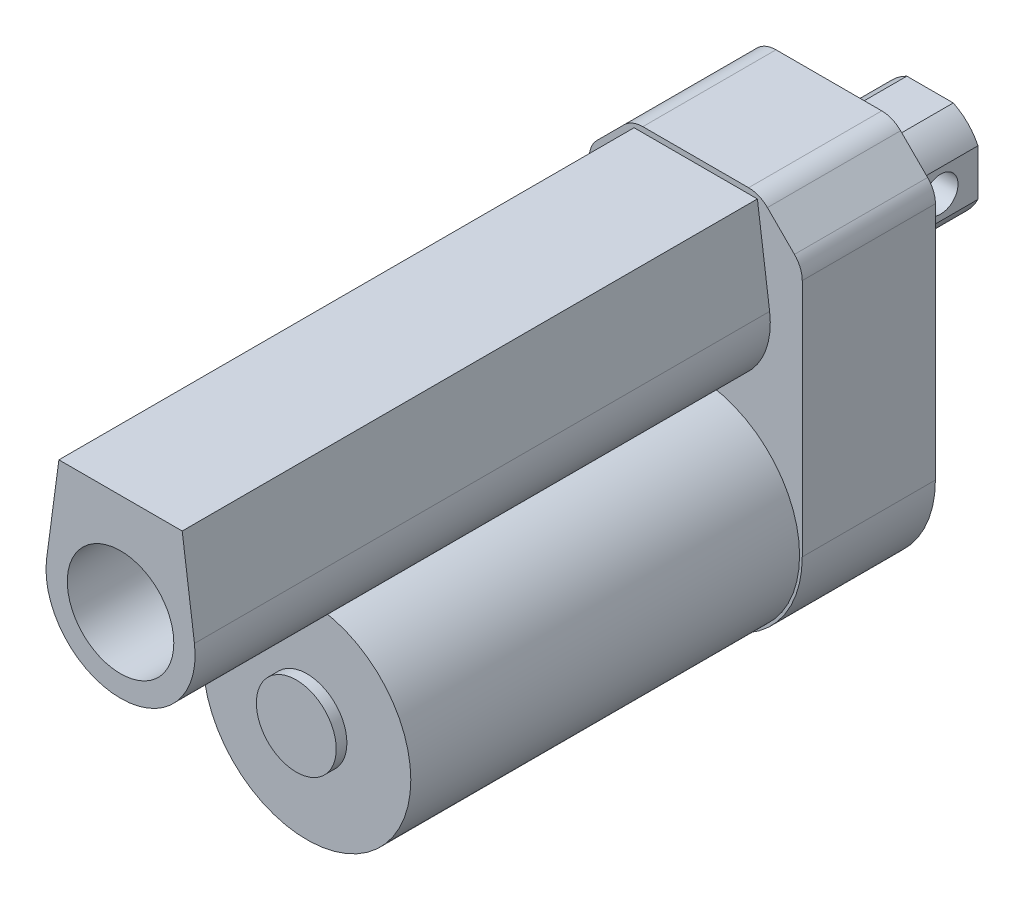
ISO-10303-21;
HEADER;
FILE_DESCRIPTION(('STEP AP214'),'2;1');
FILE_NAME('part.step','',(''),(''),'','','');
FILE_SCHEMA(('AUTOMOTIVE_DESIGN { 1 0 10303 214 1 1 1 1 }'));
ENDSEC;
DATA;
#1=APPLICATION_CONTEXT('core data for automotive mechanical design processes');
#2=APPLICATION_PROTOCOL_DEFINITION('international standard','automotive_design',2000,#1);
#3=PRODUCT_CONTEXT('',#1,'mechanical');
#4=PRODUCT('Part','Part','',(#3));
#5=PRODUCT_RELATED_PRODUCT_CATEGORY('part','',(#4));
#6=PRODUCT_DEFINITION_FORMATION('','',#4);
#7=PRODUCT_DEFINITION_CONTEXT('part definition',#1,'design');
#8=PRODUCT_DEFINITION('design','',#6,#7);
#9=PRODUCT_DEFINITION_SHAPE('','',#8);
#10=(LENGTH_UNIT() NAMED_UNIT(*) SI_UNIT(.MILLI.,.METRE.));
#11=(NAMED_UNIT(*) PLANE_ANGLE_UNIT() SI_UNIT($,.RADIAN.));
#12=(NAMED_UNIT(*) SI_UNIT($,.STERADIAN.) SOLID_ANGLE_UNIT());
#13=UNCERTAINTY_MEASURE_WITH_UNIT(LENGTH_MEASURE(1.E-05),#10,'distance_accuracy_value','');
#14=(GEOMETRIC_REPRESENTATION_CONTEXT(3) GLOBAL_UNCERTAINTY_ASSIGNED_CONTEXT((#13)) GLOBAL_UNIT_ASSIGNED_CONTEXT((#10,
#11,#12)) REPRESENTATION_CONTEXT('',''));
#15=CARTESIAN_POINT('',(0.,0.,0.));
#16=DIRECTION('',(0.,0.,1.));
#17=DIRECTION('',(1.,0.,0.));
#18=AXIS2_PLACEMENT_3D('',#15,#16,#17);
#19=CARTESIAN_POINT('',(0.,35.,-19.));
#20=DIRECTION('',(0.,0.,1.));
#21=DIRECTION('',(1.,0.,0.));
#22=AXIS2_PLACEMENT_3D('',#19,#20,#21);
#23=CYLINDRICAL_SURFACE('',#22,10.);
#24=CARTESIAN_POINT('',(0.,35.,0.));
#25=DIRECTION('',(0.,0.,-1.));
#26=DIRECTION('',(-1.,0.,0.));
#27=AXIS2_PLACEMENT_3D('',#24,#25,#26);
#28=CIRCLE('',#27,10.);
#29=CARTESIAN_POINT('',(9.00000000000001,30.6411010564594,0.));
#30=VERTEX_POINT('',#29);
#31=CARTESIAN_POINT('',(4.35889894354065,26.,0.));
#32=VERTEX_POINT('',#31);
#33=EDGE_CURVE('E141',#30,#32,#28,.T.);
#34=ORIENTED_EDGE('',*,*,#33,.T.);
#35=DIRECTION('',(0.,0.,1.));
#36=VECTOR('',#35,1.);
#37=CARTESIAN_POINT('',(4.35889894354065,26.,-19.));
#38=LINE('',#37,#36);
#39=CARTESIAN_POINT('',(4.35889894354065,26.,-19.));
#40=VERTEX_POINT('',#39);
#41=EDGE_CURVE('E12',#40,#32,#38,.T.);
#42=ORIENTED_EDGE('',*,*,#41,.F.);
#43=CARTESIAN_POINT('',(0.,35.,-19.));
#44=DIRECTION('',(0.,0.,-1.));
#45=DIRECTION('',(-1.,0.,0.));
#46=AXIS2_PLACEMENT_3D('',#43,#44,#45);
#47=CIRCLE('',#46,10.);
#48=CARTESIAN_POINT('',(9.00000000000001,30.6411010564594,-19.));
#49=VERTEX_POINT('',#48);
#50=EDGE_CURVE('E156',#49,#40,#47,.T.);
#51=ORIENTED_EDGE('',*,*,#50,.F.);
#52=DIRECTION('',(0.,0.,1.));
#53=VECTOR('',#52,1.);
#54=CARTESIAN_POINT('',(9.00000000000001,30.6411010564594,-19.));
#55=LINE('',#54,#53);
#56=EDGE_CURVE('E137',#49,#30,#55,.T.);
#57=ORIENTED_EDGE('',*,*,#56,.T.);
#58=EDGE_LOOP('',(#34,#42,#51,#57));
#59=FACE_BOUND('',#58,.T.);
#60=ADVANCED_FACE('F45',(#59),#23,.T.);
#61=CARTESIAN_POINT('',(4.35889894354065,26.,-19.));
#62=DIRECTION('',(0.,1.,0.));
#63=DIRECTION('',(0.,0.,1.));
#64=AXIS2_PLACEMENT_3D('',#61,#62,#63);
#65=PLANE('',#64);
#66=DIRECTION('',(-1.,0.,0.));
#67=VECTOR('',#66,1.);
#68=CARTESIAN_POINT('',(4.35889894354065,26.,0.));
#69=LINE('',#68,#67);
#70=CARTESIAN_POINT('',(-4.35889894354066,26.,0.));
#71=VERTEX_POINT('',#70);
#72=EDGE_CURVE('E144',#32,#71,#69,.T.);
#73=ORIENTED_EDGE('',*,*,#72,.T.);
#74=DIRECTION('',(0.,0.,1.));
#75=VECTOR('',#74,1.);
#76=CARTESIAN_POINT('',(-4.35889894354066,26.,-19.));
#77=LINE('',#76,#75);
#78=CARTESIAN_POINT('',(-4.35889894354066,26.,-19.));
#79=VERTEX_POINT('',#78);
#80=EDGE_CURVE('E53',#79,#71,#77,.T.);
#81=ORIENTED_EDGE('',*,*,#80,.F.);
#82=DIRECTION('',(-1.,0.,0.));
#83=VECTOR('',#82,1.);
#84=CARTESIAN_POINT('',(4.35889894354065,26.,-19.));
#85=LINE('',#84,#83);
#86=EDGE_CURVE('E104',#40,#79,#85,.T.);
#87=ORIENTED_EDGE('',*,*,#86,.F.);
#88=ORIENTED_EDGE('',*,*,#41,.T.);
#89=EDGE_LOOP('',(#73,#81,#87,#88));
#90=FACE_BOUND('',#89,.T.);
#91=ADVANCED_FACE('F209',(#90),#65,.F.);
#92=CARTESIAN_POINT('',(0.,35.,-19.));
#93=DIRECTION('',(0.,0.,1.));
#94=DIRECTION('',(1.,0.,0.));
#95=AXIS2_PLACEMENT_3D('',#92,#93,#94);
#96=CYLINDRICAL_SURFACE('',#95,10.);
#97=CARTESIAN_POINT('',(0.,35.,0.));
#98=DIRECTION('',(0.,0.,-1.));
#99=DIRECTION('',(-1.,0.,0.));
#100=AXIS2_PLACEMENT_3D('',#97,#98,#99);
#101=CIRCLE('',#100,10.);
#102=CARTESIAN_POINT('',(-9.00000000000001,30.6411010564594,0.));
#103=VERTEX_POINT('',#102);
#104=EDGE_CURVE('E147',#71,#103,#101,.T.);
#105=ORIENTED_EDGE('',*,*,#104,.T.);
#106=DIRECTION('',(0.,0.,1.));
#107=VECTOR('',#106,1.);
#108=CARTESIAN_POINT('',(-9.00000000000001,30.6411010564594,-19.));
#109=LINE('',#108,#107);
#110=CARTESIAN_POINT('',(-9.00000000000001,30.6411010564594,-19.));
#111=VERTEX_POINT('',#110);
#112=EDGE_CURVE('E163',#111,#103,#109,.T.);
#113=ORIENTED_EDGE('',*,*,#112,.F.);
#114=CARTESIAN_POINT('',(0.,35.,-19.));
#115=DIRECTION('',(0.,0.,-1.));
#116=DIRECTION('',(-1.,0.,0.));
#117=AXIS2_PLACEMENT_3D('',#114,#115,#116);
#118=CIRCLE('',#117,10.);
#119=EDGE_CURVE('E171',#79,#111,#118,.T.);
#120=ORIENTED_EDGE('',*,*,#119,.F.);
#121=ORIENTED_EDGE('',*,*,#80,.T.);
#122=EDGE_LOOP('',(#105,#113,#120,#121));
#123=FACE_BOUND('',#122,.T.);
#124=ADVANCED_FACE('F169',(#123),#96,.T.);
#125=CARTESIAN_POINT('',(-9.,39.3588989435407,-19.));
#126=DIRECTION('',(1.,0.,0.));
#127=DIRECTION('',(0.,1.,0.));
#128=AXIS2_PLACEMENT_3D('',#125,#126,#127);
#129=PLANE('',#128);
#130=CARTESIAN_POINT('',(-9.00000000000001,35.,-12.));
#131=DIRECTION('',(1.,0.,0.));
#132=DIRECTION('',(0.,1.,0.));
#133=AXIS2_PLACEMENT_3D('',#130,#131,#132);
#134=CIRCLE('',#133,3.25);
#135=CARTESIAN_POINT('',(-9.,38.25,-12.));
#136=VERTEX_POINT('',#135);
#137=EDGE_CURVE('E145',#136,#136,#134,.T.);
#138=ORIENTED_EDGE('',*,*,#137,.T.);
#139=EDGE_LOOP('',(#138));
#140=FACE_BOUND('',#139,.T.);
#141=DIRECTION('',(0.,1.,0.));
#142=VECTOR('',#141,1.);
#143=CARTESIAN_POINT('',(-9.,39.3588989435407,0.));
#144=LINE('',#143,#142);
#145=CARTESIAN_POINT('',(-9.,39.3588989435407,0.));
#146=VERTEX_POINT('',#145);
#147=EDGE_CURVE('E149',#103,#146,#144,.T.);
#148=ORIENTED_EDGE('',*,*,#147,.T.);
#149=DIRECTION('',(0.,0.,1.));
#150=VECTOR('',#149,1.);
#151=CARTESIAN_POINT('',(-9.,39.3588989435407,-19.));
#152=LINE('',#151,#150);
#153=CARTESIAN_POINT('',(-9.,39.3588989435407,-19.));
#154=VERTEX_POINT('',#153);
#155=EDGE_CURVE('E160',#154,#146,#152,.T.);
#156=ORIENTED_EDGE('',*,*,#155,.F.);
#157=DIRECTION('',(0.,1.,0.));
#158=VECTOR('',#157,1.);
#159=CARTESIAN_POINT('',(-9.,39.3588989435407,-19.));
#160=LINE('',#159,#158);
#161=EDGE_CURVE('E183',#111,#154,#160,.T.);
#162=ORIENTED_EDGE('',*,*,#161,.F.);
#163=ORIENTED_EDGE('',*,*,#112,.T.);
#164=EDGE_LOOP('',(#148,#156,#162,#163));
#165=FACE_BOUND('',#164,.T.);
#166=ADVANCED_FACE('F179',(#140,#165),#129,.F.);
#167=CARTESIAN_POINT('',(0.,35.,-19.));
#168=DIRECTION('',(0.,0.,1.));
#169=DIRECTION('',(1.,0.,0.));
#170=AXIS2_PLACEMENT_3D('',#167,#168,#169);
#171=CYLINDRICAL_SURFACE('',#170,10.);
#172=CARTESIAN_POINT('',(0.,35.,0.));
#173=DIRECTION('',(0.,0.,-1.));
#174=DIRECTION('',(-1.,0.,0.));
#175=AXIS2_PLACEMENT_3D('',#172,#173,#174);
#176=CIRCLE('',#175,10.);
#177=CARTESIAN_POINT('',(-4.3588989435407,44.,0.));
#178=VERTEX_POINT('',#177);
#179=EDGE_CURVE('E151',#146,#178,#176,.T.);
#180=ORIENTED_EDGE('',*,*,#179,.T.);
#181=DIRECTION('',(0.,0.,1.));
#182=VECTOR('',#181,1.);
#183=CARTESIAN_POINT('',(-4.3588989435407,44.,-19.));
#184=LINE('',#183,#182);
#185=CARTESIAN_POINT('',(-4.3588989435407,44.,-19.));
#186=VERTEX_POINT('',#185);
#187=EDGE_CURVE('E132',#186,#178,#184,.T.);
#188=ORIENTED_EDGE('',*,*,#187,.F.);
#189=CARTESIAN_POINT('',(0.,35.,-19.));
#190=DIRECTION('',(0.,0.,-1.));
#191=DIRECTION('',(-1.,0.,0.));
#192=AXIS2_PLACEMENT_3D('',#189,#190,#191);
#193=CIRCLE('',#192,10.);
#194=EDGE_CURVE('E123',#154,#186,#193,.T.);
#195=ORIENTED_EDGE('',*,*,#194,.F.);
#196=ORIENTED_EDGE('',*,*,#155,.T.);
#197=EDGE_LOOP('',(#180,#188,#195,#196));
#198=FACE_BOUND('',#197,.T.);
#199=ADVANCED_FACE('F182',(#198),#171,.T.);
#200=CARTESIAN_POINT('',(4.3588989435407,44.,-19.));
#201=DIRECTION('',(0.,-1.,0.));
#202=DIRECTION('',(0.,0.,-1.));
#203=AXIS2_PLACEMENT_3D('',#200,#201,#202);
#204=PLANE('',#203);
#205=DIRECTION('',(1.,0.,0.));
#206=VECTOR('',#205,1.);
#207=CARTESIAN_POINT('',(4.3588989435407,44.,0.));
#208=LINE('',#207,#206);
#209=CARTESIAN_POINT('',(4.3588989435407,44.,0.));
#210=VERTEX_POINT('',#209);
#211=EDGE_CURVE('E131',#178,#210,#208,.T.);
#212=ORIENTED_EDGE('',*,*,#211,.T.);
#213=DIRECTION('',(0.,0.,1.));
#214=VECTOR('',#213,1.);
#215=CARTESIAN_POINT('',(4.3588989435407,44.,-19.));
#216=LINE('',#215,#214);
#217=CARTESIAN_POINT('',(4.3588989435407,44.,-19.));
#218=VERTEX_POINT('',#217);
#219=EDGE_CURVE('E128',#218,#210,#216,.T.);
#220=ORIENTED_EDGE('',*,*,#219,.F.);
#221=DIRECTION('',(1.,0.,0.));
#222=VECTOR('',#221,1.);
#223=CARTESIAN_POINT('',(4.3588989435407,44.,-19.));
#224=LINE('',#223,#222);
#225=EDGE_CURVE('E117',#186,#218,#224,.T.);
#226=ORIENTED_EDGE('',*,*,#225,.F.);
#227=ORIENTED_EDGE('',*,*,#187,.T.);
#228=EDGE_LOOP('',(#212,#220,#226,#227));
#229=FACE_BOUND('',#228,.T.);
#230=ADVANCED_FACE('F129',(#229),#204,.F.);
#231=CARTESIAN_POINT('',(0.,35.,-19.));
#232=DIRECTION('',(0.,0.,1.));
#233=DIRECTION('',(1.,0.,0.));
#234=AXIS2_PLACEMENT_3D('',#231,#232,#233);
#235=CYLINDRICAL_SURFACE('',#234,10.);
#236=CARTESIAN_POINT('',(0.,35.,0.));
#237=DIRECTION('',(0.,0.,-1.));
#238=DIRECTION('',(-1.,0.,0.));
#239=AXIS2_PLACEMENT_3D('',#236,#237,#238);
#240=CIRCLE('',#239,10.);
#241=CARTESIAN_POINT('',(9.00000000000001,39.3588989435407,0.));
#242=VERTEX_POINT('',#241);
#243=EDGE_CURVE('E90',#210,#242,#240,.T.);
#244=ORIENTED_EDGE('',*,*,#243,.T.);
#245=DIRECTION('',(0.,0.,1.));
#246=VECTOR('',#245,1.);
#247=CARTESIAN_POINT('',(9.00000000000001,39.3588989435407,-19.));
#248=LINE('',#247,#246);
#249=CARTESIAN_POINT('',(9.00000000000001,39.3588989435407,-19.));
#250=VERTEX_POINT('',#249);
#251=EDGE_CURVE('E133',#250,#242,#248,.T.);
#252=ORIENTED_EDGE('',*,*,#251,.F.);
#253=CARTESIAN_POINT('',(0.,35.,-19.));
#254=DIRECTION('',(0.,0.,-1.));
#255=DIRECTION('',(-1.,0.,0.));
#256=AXIS2_PLACEMENT_3D('',#253,#254,#255);
#257=CIRCLE('',#256,10.);
#258=EDGE_CURVE('E121',#218,#250,#257,.T.);
#259=ORIENTED_EDGE('',*,*,#258,.F.);
#260=ORIENTED_EDGE('',*,*,#219,.T.);
#261=EDGE_LOOP('',(#244,#252,#259,#260));
#262=FACE_BOUND('',#261,.T.);
#263=ADVANCED_FACE('F135',(#262),#235,.T.);
#264=CARTESIAN_POINT('',(9.00000000000001,39.3588989435407,-19.));
#265=DIRECTION('',(-1.,0.,0.));
#266=DIRECTION('',(0.,0.,1.));
#267=AXIS2_PLACEMENT_3D('',#264,#265,#266);
#268=PLANE('',#267);
#269=CARTESIAN_POINT('',(9.00000000000001,35.,-12.));
#270=DIRECTION('',(1.,0.,0.));
#271=DIRECTION('',(0.,0.,-1.));
#272=AXIS2_PLACEMENT_3D('',#269,#270,#271);
#273=CIRCLE('',#272,3.25);
#274=CARTESIAN_POINT('',(9.00000000000001,35.,-15.25));
#275=VERTEX_POINT('',#274);
#276=EDGE_CURVE('E191',#275,#275,#273,.T.);
#277=ORIENTED_EDGE('',*,*,#276,.F.);
#278=EDGE_LOOP('',(#277));
#279=FACE_BOUND('',#278,.T.);
#280=DIRECTION('',(0.,-1.,0.));
#281=VECTOR('',#280,1.);
#282=CARTESIAN_POINT('',(9.00000000000001,39.3588989435407,0.));
#283=LINE('',#282,#281);
#284=EDGE_CURVE('E96',#242,#30,#283,.T.);
#285=ORIENTED_EDGE('',*,*,#284,.T.);
#286=ORIENTED_EDGE('',*,*,#56,.F.);
#287=DIRECTION('',(0.,-1.,0.));
#288=VECTOR('',#287,1.);
#289=CARTESIAN_POINT('',(9.00000000000001,39.3588989435407,-19.));
#290=LINE('',#289,#288);
#291=EDGE_CURVE('E61',#250,#49,#290,.T.);
#292=ORIENTED_EDGE('',*,*,#291,.F.);
#293=ORIENTED_EDGE('',*,*,#251,.T.);
#294=EDGE_LOOP('',(#285,#286,#292,#293));
#295=FACE_BOUND('',#294,.T.);
#296=ADVANCED_FACE('F198',(#279,#295),#268,.F.);
#297=CARTESIAN_POINT('',(0.,35.,-19.));
#298=DIRECTION('',(0.,0.,-1.));
#299=DIRECTION('',(-1.,0.,0.));
#300=AXIS2_PLACEMENT_3D('',#297,#298,#299);
#301=PLANE('',#300);
#302=ORIENTED_EDGE('',*,*,#50,.T.);
#303=ORIENTED_EDGE('',*,*,#86,.T.);
#304=ORIENTED_EDGE('',*,*,#119,.T.);
#305=ORIENTED_EDGE('',*,*,#161,.T.);
#306=ORIENTED_EDGE('',*,*,#194,.T.);
#307=ORIENTED_EDGE('',*,*,#225,.T.);
#308=ORIENTED_EDGE('',*,*,#258,.T.);
#309=ORIENTED_EDGE('',*,*,#291,.T.);
#310=EDGE_LOOP('',(#302,#303,#304,#305,#306,#307,#308,#309));
#311=FACE_BOUND('',#310,.T.);
#312=ADVANCED_FACE('F119',(#311),#301,.T.);
#313=CARTESIAN_POINT('',(0.,35.,0.));
#314=DIRECTION('',(0.,0.,-1.));
#315=DIRECTION('',(-1.,0.,0.));
#316=AXIS2_PLACEMENT_3D('',#313,#314,#315);
#317=PLANE('',#316);
#318=ORIENTED_EDGE('',*,*,#33,.F.);
#319=ORIENTED_EDGE('',*,*,#284,.F.);
#320=ORIENTED_EDGE('',*,*,#243,.F.);
#321=ORIENTED_EDGE('',*,*,#211,.F.);
#322=ORIENTED_EDGE('',*,*,#179,.F.);
#323=ORIENTED_EDGE('',*,*,#147,.F.);
#324=ORIENTED_EDGE('',*,*,#104,.F.);
#325=ORIENTED_EDGE('',*,*,#72,.F.);
#326=EDGE_LOOP('',(#318,#319,#320,#321,#322,#323,#324,#325));
#327=FACE_BOUND('',#326,.T.);
#328=ADVANCED_FACE('F175',(#327),#317,.F.);
#329=CARTESIAN_POINT('',(-85.,35.,-12.));
#330=DIRECTION('',(1.,0.,0.));
#331=DIRECTION('',(0.,0.,-1.));
#332=AXIS2_PLACEMENT_3D('',#329,#330,#331);
#333=CYLINDRICAL_SURFACE('',#332,3.25);
#334=ORIENTED_EDGE('',*,*,#276,.T.);
#335=EDGE_LOOP('',(#334));
#336=FACE_BOUND('',#335,.T.);
#337=ORIENTED_EDGE('',*,*,#137,.F.);
#338=EDGE_LOOP('',(#337));
#339=FACE_BOUND('',#338,.T.);
#340=ADVANCED_FACE('F195',(#336,#339),#333,.F.);
#341=CLOSED_SHELL('',(#60,#91,#124,#166,#199,#230,#263,#296,#312,#328,#340));
#342=MANIFOLD_SOLID_BREP('B2',#341);
#343=CARTESIAN_POINT('',(0.,0.,25.));
#344=DIRECTION('',(0.,0.,1.));
#345=DIRECTION('',(1.,0.,0.));
#346=AXIS2_PLACEMENT_3D('',#343,#344,#345);
#347=PLANE('',#346);
#348=CARTESIAN_POINT('',(0.,0.,25.));
#349=DIRECTION('',(0.,0.,1.));
#350=DIRECTION('',(1.,0.,0.));
#351=AXIS2_PLACEMENT_3D('',#348,#349,#350);
#352=CIRCLE('',#351,19.5);
#353=CARTESIAN_POINT('',(19.5,0.,25.));
#354=VERTEX_POINT('',#353);
#355=EDGE_CURVE('E303',#354,#354,#352,.T.);
#356=ORIENTED_EDGE('',*,*,#355,.F.);
#357=EDGE_LOOP('',(#356));
#358=FACE_BOUND('',#357,.T.);
#359=CARTESIAN_POINT('',(0.,0.,25.));
#360=DIRECTION('',(0.,0.,1.));
#361=DIRECTION('',(1.,0.,0.));
#362=AXIS2_PLACEMENT_3D('',#359,#360,#361);
#363=CIRCLE('',#362,20.);
#364=CARTESIAN_POINT('',(-20.,0.,25.));
#365=VERTEX_POINT('',#364);
#366=CARTESIAN_POINT('',(20.,0.,25.));
#367=VERTEX_POINT('',#366);
#368=EDGE_CURVE('E438',#365,#367,#363,.T.);
#369=ORIENTED_EDGE('',*,*,#368,.T.);
#370=DIRECTION('',(0.,1.,0.));
#371=VECTOR('',#370,1.);
#372=CARTESIAN_POINT('',(20.,44.9289321881345,25.));
#373=LINE('',#372,#371);
#374=CARTESIAN_POINT('',(20.,44.9289321881345,25.));
#375=VERTEX_POINT('',#374);
#376=EDGE_CURVE('E368',#367,#375,#373,.T.);
#377=ORIENTED_EDGE('',*,*,#376,.T.);
#378=CARTESIAN_POINT('',(15.,44.9289321881345,25.));
#379=DIRECTION('',(0.,0.,1.));
#380=DIRECTION('',(1.,0.,0.));
#381=AXIS2_PLACEMENT_3D('',#378,#379,#380);
#382=CIRCLE('',#381,5.);
#383=CARTESIAN_POINT('',(18.5355339059327,48.4644660940673,25.));
#384=VERTEX_POINT('',#383);
#385=EDGE_CURVE('E467',#375,#384,#382,.T.);
#386=ORIENTED_EDGE('',*,*,#385,.T.);
#387=DIRECTION('',(-0.707106781186547,0.707106781186548,0.));
#388=VECTOR('',#387,1.);
#389=CARTESIAN_POINT('',(13.4644660940673,53.5355339059327,25.));
#390=LINE('',#389,#388);
#391=CARTESIAN_POINT('',(13.4644660940673,53.5355339059327,25.));
#392=VERTEX_POINT('',#391);
#393=EDGE_CURVE('E469',#384,#392,#390,.T.);
#394=ORIENTED_EDGE('',*,*,#393,.T.);
#395=CARTESIAN_POINT('',(9.92893218813453,50.,25.));
#396=DIRECTION('',(0.,0.,1.));
#397=DIRECTION('',(1.,0.,0.));
#398=AXIS2_PLACEMENT_3D('',#395,#396,#397);
#399=CIRCLE('',#398,5.);
#400=CARTESIAN_POINT('',(9.92893218813453,55.,25.));
#401=VERTEX_POINT('',#400);
#402=EDGE_CURVE('E471',#392,#401,#399,.T.);
#403=ORIENTED_EDGE('',*,*,#402,.T.);
#404=DIRECTION('',(-1.,0.,0.));
#405=VECTOR('',#404,1.);
#406=CARTESIAN_POINT('',(-9.92893218813452,55.,25.));
#407=LINE('',#406,#405);
#408=CARTESIAN_POINT('',(-9.92893218813452,55.,25.));
#409=VERTEX_POINT('',#408);
#410=EDGE_CURVE('E473',#401,#409,#407,.T.);
#411=ORIENTED_EDGE('',*,*,#410,.T.);
#412=CARTESIAN_POINT('',(-9.92893218813452,50.,25.));
#413=DIRECTION('',(0.,0.,1.));
#414=DIRECTION('',(-1.,0.,0.));
#415=AXIS2_PLACEMENT_3D('',#412,#413,#414);
#416=CIRCLE('',#415,5.);
#417=CARTESIAN_POINT('',(-13.4644660940673,53.5355339059327,25.));
#418=VERTEX_POINT('',#417);
#419=EDGE_CURVE('E397',#409,#418,#416,.T.);
#420=ORIENTED_EDGE('',*,*,#419,.T.);
#421=DIRECTION('',(-0.707106781186547,-0.707106781186548,0.));
#422=VECTOR('',#421,1.);
#423=CARTESIAN_POINT('',(-18.5355339059327,48.4644660940673,25.));
#424=LINE('',#423,#422);
#425=CARTESIAN_POINT('',(-18.5355339059327,48.4644660940673,25.));
#426=VERTEX_POINT('',#425);
#427=EDGE_CURVE('E390',#418,#426,#424,.T.);
#428=ORIENTED_EDGE('',*,*,#427,.T.);
#429=CARTESIAN_POINT('',(-15.,44.9289321881345,25.));
#430=DIRECTION('',(0.,0.,1.));
#431=DIRECTION('',(-1.,0.,0.));
#432=AXIS2_PLACEMENT_3D('',#429,#430,#431);
#433=CIRCLE('',#432,5.);
#434=CARTESIAN_POINT('',(-20.,44.9289321881345,25.));
#435=VERTEX_POINT('',#434);
#436=EDGE_CURVE('E394',#426,#435,#433,.T.);
#437=ORIENTED_EDGE('',*,*,#436,.T.);
#438=DIRECTION('',(0.,-1.,0.));
#439=VECTOR('',#438,1.);
#440=CARTESIAN_POINT('',(-20.,0.,25.));
#441=LINE('',#440,#439);
#442=EDGE_CURVE('E320',#435,#365,#441,.T.);
#443=ORIENTED_EDGE('',*,*,#442,.T.);
#444=EDGE_LOOP('',(#369,#377,#386,#394,#403,#411,#420,#428,#437,#443));
#445=FACE_BOUND('',#444,.T.);
#446=DIRECTION('',(-0.13296122052609,-0.991121240735064,0.));
#447=VECTOR('',#446,1.);
#448=CARTESIAN_POINT('',(-11.5765219616268,54.,25.));
#449=LINE('',#448,#447);
#450=CARTESIAN_POINT('',(-11.5765219616268,54.,25.));
#451=VERTEX_POINT('',#450);
#452=CARTESIAN_POINT('',(-13.8756973702909,36.8614570873653,25.));
#453=VERTEX_POINT('',#452);
#454=EDGE_CURVE('E706',#451,#453,#449,.T.);
#455=ORIENTED_EDGE('',*,*,#454,.F.);
#456=DIRECTION('',(-1.,0.,0.));
#457=VECTOR('',#456,1.);
#458=CARTESIAN_POINT('',(-11.5765219616268,54.,25.));
#459=LINE('',#458,#457);
#460=CARTESIAN_POINT('',(11.5765219616268,54.,25.));
#461=VERTEX_POINT('',#460);
#462=EDGE_CURVE('E703',#461,#451,#459,.T.);
#463=ORIENTED_EDGE('',*,*,#462,.F.);
#464=DIRECTION('',(-0.13296122052609,0.991121240735064,0.));
#465=VECTOR('',#464,1.);
#466=CARTESIAN_POINT('',(11.5765219616268,54.,25.));
#467=LINE('',#466,#465);
#468=CARTESIAN_POINT('',(13.8756973702909,36.8614570873653,25.));
#469=VERTEX_POINT('',#468);
#470=EDGE_CURVE('E714',#469,#461,#467,.T.);
#471=ORIENTED_EDGE('',*,*,#470,.F.);
#472=CARTESIAN_POINT('',(0.,35.,25.));
#473=DIRECTION('',(0.,0.,1.));
#474=DIRECTION('',(1.,0.,0.));
#475=AXIS2_PLACEMENT_3D('',#472,#473,#474);
#476=CIRCLE('',#475,14.);
#477=EDGE_CURVE('E726',#453,#469,#476,.T.);
#478=ORIENTED_EDGE('',*,*,#477,.F.);
#479=EDGE_LOOP('',(#455,#463,#471,#478));
#480=FACE_BOUND('',#479,.T.);
#481=ADVANCED_FACE('F294',(#358,#445,#480),#347,.T.);
#482=CARTESIAN_POINT('',(0.,0.,25.));
#483=DIRECTION('',(0.,0.,-1.));
#484=DIRECTION('',(-1.,0.,0.));
#485=AXIS2_PLACEMENT_3D('',#482,#483,#484);
#486=CYLINDRICAL_SURFACE('',#485,20.);
#487=CARTESIAN_POINT('',(0.,0.,0.));
#488=DIRECTION('',(0.,0.,1.));
#489=DIRECTION('',(1.,0.,0.));
#490=AXIS2_PLACEMENT_3D('',#487,#488,#489);
#491=CIRCLE('',#490,20.);
#492=CARTESIAN_POINT('',(-20.,0.,0.));
#493=VERTEX_POINT('',#492);
#494=CARTESIAN_POINT('',(20.,0.,0.));
#495=VERTEX_POINT('',#494);
#496=EDGE_CURVE('E418',#493,#495,#491,.T.);
#497=ORIENTED_EDGE('',*,*,#496,.T.);
#498=DIRECTION('',(0.,0.,-1.));
#499=VECTOR('',#498,1.);
#500=CARTESIAN_POINT('',(20.,0.,25.));
#501=LINE('',#500,#499);
#502=EDGE_CURVE('E298',#367,#495,#501,.T.);
#503=ORIENTED_EDGE('',*,*,#502,.F.);
#504=ORIENTED_EDGE('',*,*,#368,.F.);
#505=DIRECTION('',(0.,0.,-1.));
#506=VECTOR('',#505,1.);
#507=CARTESIAN_POINT('',(-20.,0.,25.));
#508=LINE('',#507,#506);
#509=EDGE_CURVE('E414',#365,#493,#508,.T.);
#510=ORIENTED_EDGE('',*,*,#509,.T.);
#511=EDGE_LOOP('',(#497,#503,#504,#510));
#512=FACE_BOUND('',#511,.T.);
#513=ADVANCED_FACE('F296',(#512),#486,.T.);
#514=CARTESIAN_POINT('',(20.,44.9289321881345,25.));
#515=DIRECTION('',(-1.,0.,0.));
#516=DIRECTION('',(0.,-1.,0.));
#517=AXIS2_PLACEMENT_3D('',#514,#515,#516);
#518=PLANE('',#517);
#519=DIRECTION('',(0.,1.,0.));
#520=VECTOR('',#519,1.);
#521=CARTESIAN_POINT('',(20.,44.9289321881345,0.));
#522=LINE('',#521,#520);
#523=CARTESIAN_POINT('',(20.,44.9289321881345,0.));
#524=VERTEX_POINT('',#523);
#525=EDGE_CURVE('E421',#495,#524,#522,.T.);
#526=ORIENTED_EDGE('',*,*,#525,.T.);
#527=DIRECTION('',(0.,0.,-1.));
#528=VECTOR('',#527,1.);
#529=CARTESIAN_POINT('',(20.,44.9289321881345,25.));
#530=LINE('',#529,#528);
#531=EDGE_CURVE('E453',#375,#524,#530,.T.);
#532=ORIENTED_EDGE('',*,*,#531,.F.);
#533=ORIENTED_EDGE('',*,*,#376,.F.);
#534=ORIENTED_EDGE('',*,*,#502,.T.);
#535=EDGE_LOOP('',(#526,#532,#533,#534));
#536=FACE_BOUND('',#535,.T.);
#537=ADVANCED_FACE('F491',(#536),#518,.F.);
#538=CARTESIAN_POINT('',(15.,44.9289321881345,25.));
#539=DIRECTION('',(0.,0.,-1.));
#540=DIRECTION('',(-1.,0.,0.));
#541=AXIS2_PLACEMENT_3D('',#538,#539,#540);
#542=CYLINDRICAL_SURFACE('',#541,5.);
#543=CARTESIAN_POINT('',(15.,44.9289321881345,0.));
#544=DIRECTION('',(0.,0.,1.));
#545=DIRECTION('',(1.,0.,0.));
#546=AXIS2_PLACEMENT_3D('',#543,#544,#545);
#547=CIRCLE('',#546,5.);
#548=CARTESIAN_POINT('',(18.5355339059327,48.4644660940673,0.));
#549=VERTEX_POINT('',#548);
#550=EDGE_CURVE('E424',#524,#549,#547,.T.);
#551=ORIENTED_EDGE('',*,*,#550,.T.);
#552=DIRECTION('',(0.,0.,-1.));
#553=VECTOR('',#552,1.);
#554=CARTESIAN_POINT('',(18.5355339059327,48.4644660940673,25.));
#555=LINE('',#554,#553);
#556=EDGE_CURVE('E451',#384,#549,#555,.T.);
#557=ORIENTED_EDGE('',*,*,#556,.F.);
#558=ORIENTED_EDGE('',*,*,#385,.F.);
#559=ORIENTED_EDGE('',*,*,#531,.T.);
#560=EDGE_LOOP('',(#551,#557,#558,#559));
#561=FACE_BOUND('',#560,.T.);
#562=ADVANCED_FACE('F492',(#561),#542,.T.);
#563=CARTESIAN_POINT('',(13.4644660940673,53.5355339059327,25.));
#564=DIRECTION('',(-0.707106781186548,-0.707106781186547,0.));
#565=DIRECTION('',(0.707106781186547,-0.707106781186548,0.));
#566=AXIS2_PLACEMENT_3D('',#563,#564,#565);
#567=PLANE('',#566);
#568=DIRECTION('',(-0.707106781186547,0.707106781186548,0.));
#569=VECTOR('',#568,1.);
#570=CARTESIAN_POINT('',(13.4644660940673,53.5355339059327,0.));
#571=LINE('',#570,#569);
#572=CARTESIAN_POINT('',(13.4644660940673,53.5355339059327,0.));
#573=VERTEX_POINT('',#572);
#574=EDGE_CURVE('E426',#549,#573,#571,.T.);
#575=ORIENTED_EDGE('',*,*,#574,.T.);
#576=DIRECTION('',(0.,0.,-1.));
#577=VECTOR('',#576,1.);
#578=CARTESIAN_POINT('',(13.4644660940673,53.5355339059327,25.));
#579=LINE('',#578,#577);
#580=EDGE_CURVE('E448',#392,#573,#579,.T.);
#581=ORIENTED_EDGE('',*,*,#580,.F.);
#582=ORIENTED_EDGE('',*,*,#393,.F.);
#583=ORIENTED_EDGE('',*,*,#556,.T.);
#584=EDGE_LOOP('',(#575,#581,#582,#583));
#585=FACE_BOUND('',#584,.T.);
#586=ADVANCED_FACE('F497',(#585),#567,.F.);
#587=CARTESIAN_POINT('',(9.92893218813453,50.,25.));
#588=DIRECTION('',(0.,0.,-1.));
#589=DIRECTION('',(-1.,0.,0.));
#590=AXIS2_PLACEMENT_3D('',#587,#588,#589);
#591=CYLINDRICAL_SURFACE('',#590,5.);
#592=CARTESIAN_POINT('',(9.92893218813453,50.,0.));
#593=DIRECTION('',(0.,0.,1.));
#594=DIRECTION('',(1.,0.,0.));
#595=AXIS2_PLACEMENT_3D('',#592,#593,#594);
#596=CIRCLE('',#595,5.);
#597=CARTESIAN_POINT('',(9.92893218813453,55.,0.));
#598=VERTEX_POINT('',#597);
#599=EDGE_CURVE('E428',#573,#598,#596,.T.);
#600=ORIENTED_EDGE('',*,*,#599,.T.);
#601=DIRECTION('',(0.,0.,-1.));
#602=VECTOR('',#601,1.);
#603=CARTESIAN_POINT('',(9.92893218813453,55.,25.));
#604=LINE('',#603,#602);
#605=EDGE_CURVE('E445',#401,#598,#604,.T.);
#606=ORIENTED_EDGE('',*,*,#605,.F.);
#607=ORIENTED_EDGE('',*,*,#402,.F.);
#608=ORIENTED_EDGE('',*,*,#580,.T.);
#609=EDGE_LOOP('',(#600,#606,#607,#608));
#610=FACE_BOUND('',#609,.T.);
#611=ADVANCED_FACE('F500',(#610),#591,.T.);
#612=CARTESIAN_POINT('',(-9.92893218813452,55.,25.));
#613=DIRECTION('',(0.,-1.,0.));
#614=DIRECTION('',(0.,0.,-1.));
#615=AXIS2_PLACEMENT_3D('',#612,#613,#614);
#616=PLANE('',#615);
#617=DIRECTION('',(-1.,0.,0.));
#618=VECTOR('',#617,1.);
#619=CARTESIAN_POINT('',(-9.92893218813452,55.,0.));
#620=LINE('',#619,#618);
#621=CARTESIAN_POINT('',(-9.92893218813452,55.,0.));
#622=VERTEX_POINT('',#621);
#623=EDGE_CURVE('E430',#598,#622,#620,.T.);
#624=ORIENTED_EDGE('',*,*,#623,.T.);
#625=DIRECTION('',(0.,0.,-1.));
#626=VECTOR('',#625,1.);
#627=CARTESIAN_POINT('',(-9.92893218813452,55.,25.));
#628=LINE('',#627,#626);
#629=EDGE_CURVE('E442',#409,#622,#628,.T.);
#630=ORIENTED_EDGE('',*,*,#629,.F.);
#631=ORIENTED_EDGE('',*,*,#410,.F.);
#632=ORIENTED_EDGE('',*,*,#605,.T.);
#633=EDGE_LOOP('',(#624,#630,#631,#632));
#634=FACE_BOUND('',#633,.T.);
#635=ADVANCED_FACE('F479',(#634),#616,.F.);
#636=CARTESIAN_POINT('',(-9.92893218813452,50.,25.));
#637=DIRECTION('',(0.,0.,-1.));
#638=DIRECTION('',(-1.,0.,0.));
#639=AXIS2_PLACEMENT_3D('',#636,#637,#638);
#640=CYLINDRICAL_SURFACE('',#639,5.);
#641=CARTESIAN_POINT('',(-9.92893218813452,50.,0.));
#642=DIRECTION('',(0.,0.,1.));
#643=DIRECTION('',(-1.,0.,0.));
#644=AXIS2_PLACEMENT_3D('',#641,#642,#643);
#645=CIRCLE('',#644,5.);
#646=CARTESIAN_POINT('',(-13.4644660940673,53.5355339059327,0.));
#647=VERTEX_POINT('',#646);
#648=EDGE_CURVE('E432',#622,#647,#645,.T.);
#649=ORIENTED_EDGE('',*,*,#648,.T.);
#650=DIRECTION('',(0.,0.,-1.));
#651=VECTOR('',#650,1.);
#652=CARTESIAN_POINT('',(-13.4644660940673,53.5355339059327,25.));
#653=LINE('',#652,#651);
#654=EDGE_CURVE('E409',#418,#647,#653,.T.);
#655=ORIENTED_EDGE('',*,*,#654,.F.);
#656=ORIENTED_EDGE('',*,*,#419,.F.);
#657=ORIENTED_EDGE('',*,*,#629,.T.);
#658=EDGE_LOOP('',(#649,#655,#656,#657));
#659=FACE_BOUND('',#658,.T.);
#660=ADVANCED_FACE('F483',(#659),#640,.T.);
#661=CARTESIAN_POINT('',(-18.5355339059327,48.4644660940673,25.));
#662=DIRECTION('',(0.707106781186548,-0.707106781186547,0.));
#663=DIRECTION('',(0.707106781186547,0.707106781186548,0.));
#664=AXIS2_PLACEMENT_3D('',#661,#662,#663);
#665=PLANE('',#664);
#666=DIRECTION('',(-0.707106781186547,-0.707106781186548,0.));
#667=VECTOR('',#666,1.);
#668=CARTESIAN_POINT('',(-18.5355339059327,48.4644660940673,0.));
#669=LINE('',#668,#667);
#670=CARTESIAN_POINT('',(-18.5355339059327,48.4644660940673,0.));
#671=VERTEX_POINT('',#670);
#672=EDGE_CURVE('E406',#647,#671,#669,.T.);
#673=ORIENTED_EDGE('',*,*,#672,.T.);
#674=DIRECTION('',(0.,0.,-1.));
#675=VECTOR('',#674,1.);
#676=CARTESIAN_POINT('',(-18.5355339059327,48.4644660940673,25.));
#677=LINE('',#676,#675);
#678=EDGE_CURVE('E403',#426,#671,#677,.T.);
#679=ORIENTED_EDGE('',*,*,#678,.F.);
#680=ORIENTED_EDGE('',*,*,#427,.F.);
#681=ORIENTED_EDGE('',*,*,#654,.T.);
#682=EDGE_LOOP('',(#673,#679,#680,#681));
#683=FACE_BOUND('',#682,.T.);
#684=ADVANCED_FACE('F404',(#683),#665,.F.);
#685=CARTESIAN_POINT('',(-15.,44.9289321881345,25.));
#686=DIRECTION('',(0.,0.,-1.));
#687=DIRECTION('',(-1.,0.,0.));
#688=AXIS2_PLACEMENT_3D('',#685,#686,#687);
#689=CYLINDRICAL_SURFACE('',#688,5.);
#690=CARTESIAN_POINT('',(-15.,44.9289321881345,0.));
#691=DIRECTION('',(0.,0.,1.));
#692=DIRECTION('',(-1.,0.,0.));
#693=AXIS2_PLACEMENT_3D('',#690,#691,#692);
#694=CIRCLE('',#693,5.);
#695=CARTESIAN_POINT('',(-20.,44.9289321881345,0.));
#696=VERTEX_POINT('',#695);
#697=EDGE_CURVE('E435',#671,#696,#694,.T.);
#698=ORIENTED_EDGE('',*,*,#697,.T.);
#699=DIRECTION('',(0.,0.,-1.));
#700=VECTOR('',#699,1.);
#701=CARTESIAN_POINT('',(-20.,44.9289321881345,25.));
#702=LINE('',#701,#700);
#703=EDGE_CURVE('E410',#435,#696,#702,.T.);
#704=ORIENTED_EDGE('',*,*,#703,.F.);
#705=ORIENTED_EDGE('',*,*,#436,.F.);
#706=ORIENTED_EDGE('',*,*,#678,.T.);
#707=EDGE_LOOP('',(#698,#704,#705,#706));
#708=FACE_BOUND('',#707,.T.);
#709=ADVANCED_FACE('F412',(#708),#689,.T.);
#710=CARTESIAN_POINT('',(-20.,0.,25.));
#711=DIRECTION('',(1.,0.,0.));
#712=DIRECTION('',(0.,0.,-1.));
#713=AXIS2_PLACEMENT_3D('',#710,#711,#712);
#714=PLANE('',#713);
#715=DIRECTION('',(0.,-1.,0.));
#716=VECTOR('',#715,1.);
#717=CARTESIAN_POINT('',(-20.,0.,0.));
#718=LINE('',#717,#716);
#719=EDGE_CURVE('E359',#696,#493,#718,.T.);
#720=ORIENTED_EDGE('',*,*,#719,.T.);
#721=ORIENTED_EDGE('',*,*,#509,.F.);
#722=ORIENTED_EDGE('',*,*,#442,.F.);
#723=ORIENTED_EDGE('',*,*,#703,.T.);
#724=EDGE_LOOP('',(#720,#721,#722,#723));
#725=FACE_BOUND('',#724,.T.);
#726=ADVANCED_FACE('F487',(#725),#714,.F.);
#727=CARTESIAN_POINT('',(0.,0.,0.));
#728=DIRECTION('',(0.,0.,1.));
#729=DIRECTION('',(1.,0.,0.));
#730=AXIS2_PLACEMENT_3D('',#727,#728,#729);
#731=PLANE('',#730);
#732=CARTESIAN_POINT('',(0.,35.,0.));
#733=DIRECTION('',(0.,0.,1.));
#734=DIRECTION('',(1.,0.,0.));
#735=AXIS2_PLACEMENT_3D('',#732,#733,#734);
#736=CIRCLE('',#735,10.);
#737=CARTESIAN_POINT('',(10.,35.,0.));
#738=VERTEX_POINT('',#737);
#739=EDGE_CURVE('E702',#738,#738,#736,.T.);
#740=ORIENTED_EDGE('',*,*,#739,.T.);
#741=EDGE_LOOP('',(#740));
#742=FACE_BOUND('',#741,.T.);
#743=ORIENTED_EDGE('',*,*,#496,.F.);
#744=ORIENTED_EDGE('',*,*,#719,.F.);
#745=ORIENTED_EDGE('',*,*,#697,.F.);
#746=ORIENTED_EDGE('',*,*,#672,.F.);
#747=ORIENTED_EDGE('',*,*,#648,.F.);
#748=ORIENTED_EDGE('',*,*,#623,.F.);
#749=ORIENTED_EDGE('',*,*,#599,.F.);
#750=ORIENTED_EDGE('',*,*,#574,.F.);
#751=ORIENTED_EDGE('',*,*,#550,.F.);
#752=ORIENTED_EDGE('',*,*,#525,.F.);
#753=EDGE_LOOP('',(#743,#744,#745,#746,#747,#748,#749,#750,#751,#752));
#754=FACE_BOUND('',#753,.T.);
#755=ADVANCED_FACE('F486',(#742,#754),#731,.F.);
#756=CARTESIAN_POINT('',(0.,0.,98.));
#757=DIRECTION('',(0.,0.,-1.));
#758=DIRECTION('',(-1.,0.,0.));
#759=AXIS2_PLACEMENT_3D('',#756,#757,#758);
#760=CYLINDRICAL_SURFACE('',#759,19.5);
#761=CARTESIAN_POINT('',(0.,0.,98.));
#762=DIRECTION('',(0.,0.,1.));
#763=DIRECTION('',(1.,0.,0.));
#764=AXIS2_PLACEMENT_3D('',#761,#762,#763);
#765=CIRCLE('',#764,19.5);
#766=CARTESIAN_POINT('',(19.5,0.,98.));
#767=VERTEX_POINT('',#766);
#768=EDGE_CURVE('E422',#767,#767,#765,.T.);
#769=ORIENTED_EDGE('',*,*,#768,.F.);
#770=EDGE_LOOP('',(#769));
#771=FACE_BOUND('',#770,.T.);
#772=ORIENTED_EDGE('',*,*,#355,.T.);
#773=EDGE_LOOP('',(#772));
#774=FACE_BOUND('',#773,.T.);
#775=ADVANCED_FACE('F517',(#771,#774),#760,.T.);
#776=CARTESIAN_POINT('',(0.,0.,98.));
#777=DIRECTION('',(0.,0.,1.));
#778=DIRECTION('',(1.,0.,0.));
#779=AXIS2_PLACEMENT_3D('',#776,#777,#778);
#780=PLANE('',#779);
#781=CARTESIAN_POINT('',(0.,0.,98.));
#782=DIRECTION('',(0.,0.,1.));
#783=DIRECTION('',(1.,0.,0.));
#784=AXIS2_PLACEMENT_3D('',#781,#782,#783);
#785=CIRCLE('',#784,7.5);
#786=CARTESIAN_POINT('',(7.5,0.,98.));
#787=VERTEX_POINT('',#786);
#788=EDGE_CURVE('E43',#787,#787,#785,.T.);
#789=ORIENTED_EDGE('',*,*,#788,.F.);
#790=EDGE_LOOP('',(#789));
#791=FACE_BOUND('',#790,.T.);
#792=ORIENTED_EDGE('',*,*,#768,.T.);
#793=EDGE_LOOP('',(#792));
#794=FACE_BOUND('',#793,.T.);
#795=ADVANCED_FACE('F557',(#791,#794),#780,.T.);
#796=CARTESIAN_POINT('',(0.,0.,100.));
#797=DIRECTION('',(0.,0.,-1.));
#798=DIRECTION('',(-1.,0.,0.));
#799=AXIS2_PLACEMENT_3D('',#796,#797,#798);
#800=CYLINDRICAL_SURFACE('',#799,7.5);
#801=CARTESIAN_POINT('',(0.,0.,100.));
#802=DIRECTION('',(0.,0.,1.));
#803=DIRECTION('',(1.,0.,0.));
#804=AXIS2_PLACEMENT_3D('',#801,#802,#803);
#805=CIRCLE('',#804,7.5);
#806=CARTESIAN_POINT('',(7.5,0.,100.));
#807=VERTEX_POINT('',#806);
#808=EDGE_CURVE('E738',#807,#807,#805,.T.);
#809=ORIENTED_EDGE('',*,*,#808,.F.);
#810=EDGE_LOOP('',(#809));
#811=FACE_BOUND('',#810,.T.);
#812=ORIENTED_EDGE('',*,*,#788,.T.);
#813=EDGE_LOOP('',(#812));
#814=FACE_BOUND('',#813,.T.);
#815=ADVANCED_FACE('F564',(#811,#814),#800,.T.);
#816=CARTESIAN_POINT('',(0.,0.,100.));
#817=DIRECTION('',(0.,0.,1.));
#818=DIRECTION('',(1.,0.,0.));
#819=AXIS2_PLACEMENT_3D('',#816,#817,#818);
#820=PLANE('',#819);
#821=ORIENTED_EDGE('',*,*,#808,.T.);
#822=EDGE_LOOP('',(#821));
#823=FACE_BOUND('',#822,.T.);
#824=ADVANCED_FACE('F571',(#823),#820,.T.);
#825=CARTESIAN_POINT('',(-11.5765219616268,54.,133.));
#826=DIRECTION('',(0.,-1.,0.));
#827=DIRECTION('',(0.,0.,-1.));
#828=AXIS2_PLACEMENT_3D('',#825,#826,#827);
#829=PLANE('',#828);
#830=ORIENTED_EDGE('',*,*,#462,.T.);
#831=DIRECTION('',(0.,0.,-1.));
#832=VECTOR('',#831,1.);
#833=CARTESIAN_POINT('',(-11.5765219616268,54.,133.));
#834=LINE('',#833,#832);
#835=CARTESIAN_POINT('',(-11.5765219616268,54.,133.));
#836=VERTEX_POINT('',#835);
#837=EDGE_CURVE('E735',#836,#451,#834,.T.);
#838=ORIENTED_EDGE('',*,*,#837,.F.);
#839=DIRECTION('',(-1.,0.,0.));
#840=VECTOR('',#839,1.);
#841=CARTESIAN_POINT('',(-11.5765219616268,54.,133.));
#842=LINE('',#841,#840);
#843=CARTESIAN_POINT('',(11.5765219616268,54.,133.));
#844=VERTEX_POINT('',#843);
#845=EDGE_CURVE('E710',#844,#836,#842,.T.);
#846=ORIENTED_EDGE('',*,*,#845,.F.);
#847=DIRECTION('',(0.,0.,-1.));
#848=VECTOR('',#847,1.);
#849=CARTESIAN_POINT('',(11.5765219616268,54.,133.));
#850=LINE('',#849,#848);
#851=EDGE_CURVE('E722',#844,#461,#850,.T.);
#852=ORIENTED_EDGE('',*,*,#851,.T.);
#853=EDGE_LOOP('',(#830,#838,#846,#852));
#854=FACE_BOUND('',#853,.T.);
#855=ADVANCED_FACE('F579',(#854),#829,.F.);
#856=CARTESIAN_POINT('',(-11.5765219616268,54.,133.));
#857=DIRECTION('',(0.991121240735064,-0.13296122052609,0.));
#858=DIRECTION('',(0.13296122052609,0.991121240735064,0.));
#859=AXIS2_PLACEMENT_3D('',#856,#857,#858);
#860=PLANE('',#859);
#861=ORIENTED_EDGE('',*,*,#454,.T.);
#862=DIRECTION('',(0.,0.,-1.));
#863=VECTOR('',#862,1.);
#864=CARTESIAN_POINT('',(-13.8756973702909,36.8614570873653,133.));
#865=LINE('',#864,#863);
#866=CARTESIAN_POINT('',(-13.8756973702909,36.8614570873653,133.));
#867=VERTEX_POINT('',#866);
#868=EDGE_CURVE('E732',#867,#453,#865,.T.);
#869=ORIENTED_EDGE('',*,*,#868,.F.);
#870=DIRECTION('',(-0.13296122052609,-0.991121240735064,0.));
#871=VECTOR('',#870,1.);
#872=CARTESIAN_POINT('',(-11.5765219616268,54.,133.));
#873=LINE('',#872,#871);
#874=EDGE_CURVE('E713',#836,#867,#873,.T.);
#875=ORIENTED_EDGE('',*,*,#874,.F.);
#876=ORIENTED_EDGE('',*,*,#837,.T.);
#877=EDGE_LOOP('',(#861,#869,#875,#876));
#878=FACE_BOUND('',#877,.T.);
#879=ADVANCED_FACE('F587',(#878),#860,.F.);
#880=CARTESIAN_POINT('',(0.,35.,133.));
#881=DIRECTION('',(0.,0.,-1.));
#882=DIRECTION('',(-1.,0.,0.));
#883=AXIS2_PLACEMENT_3D('',#880,#881,#882);
#884=CYLINDRICAL_SURFACE('',#883,14.);
#885=ORIENTED_EDGE('',*,*,#477,.T.);
#886=DIRECTION('',(0.,0.,-1.));
#887=VECTOR('',#886,1.);
#888=CARTESIAN_POINT('',(13.8756973702909,36.8614570873653,133.));
#889=LINE('',#888,#887);
#890=CARTESIAN_POINT('',(13.8756973702909,36.8614570873653,133.));
#891=VERTEX_POINT('',#890);
#892=EDGE_CURVE('E311',#891,#469,#889,.T.);
#893=ORIENTED_EDGE('',*,*,#892,.F.);
#894=CARTESIAN_POINT('',(0.,35.,133.));
#895=DIRECTION('',(0.,0.,1.));
#896=DIRECTION('',(1.,0.,0.));
#897=AXIS2_PLACEMENT_3D('',#894,#895,#896);
#898=CIRCLE('',#897,14.);
#899=EDGE_CURVE('E717',#867,#891,#898,.T.);
#900=ORIENTED_EDGE('',*,*,#899,.F.);
#901=ORIENTED_EDGE('',*,*,#868,.T.);
#902=EDGE_LOOP('',(#885,#893,#900,#901));
#903=FACE_BOUND('',#902,.T.);
#904=ADVANCED_FACE('F595',(#903),#884,.T.);
#905=CARTESIAN_POINT('',(11.5765219616268,54.,133.));
#906=DIRECTION('',(-0.991121240735064,-0.13296122052609,0.));
#907=DIRECTION('',(0.13296122052609,-0.991121240735064,0.));
#908=AXIS2_PLACEMENT_3D('',#905,#906,#907);
#909=PLANE('',#908);
#910=ORIENTED_EDGE('',*,*,#470,.T.);
#911=ORIENTED_EDGE('',*,*,#851,.F.);
#912=DIRECTION('',(-0.13296122052609,0.991121240735064,0.));
#913=VECTOR('',#912,1.);
#914=CARTESIAN_POINT('',(11.5765219616268,54.,133.));
#915=LINE('',#914,#913);
#916=EDGE_CURVE('E720',#891,#844,#915,.T.);
#917=ORIENTED_EDGE('',*,*,#916,.F.);
#918=ORIENTED_EDGE('',*,*,#892,.T.);
#919=EDGE_LOOP('',(#910,#911,#917,#918));
#920=FACE_BOUND('',#919,.T.);
#921=ADVANCED_FACE('F603',(#920),#909,.F.);
#922=CARTESIAN_POINT('',(0.,35.,133.));
#923=DIRECTION('',(0.,0.,1.));
#924=DIRECTION('',(1.,0.,0.));
#925=AXIS2_PLACEMENT_3D('',#922,#923,#924);
#926=PLANE('',#925);
#927=CARTESIAN_POINT('',(0.,35.,133.));
#928=DIRECTION('',(0.,0.,1.));
#929=DIRECTION('',(1.,0.,0.));
#930=AXIS2_PLACEMENT_3D('',#927,#928,#929);
#931=CIRCLE('',#930,10.);
#932=CARTESIAN_POINT('',(10.,35.,133.));
#933=VERTEX_POINT('',#932);
#934=EDGE_CURVE('E699',#933,#933,#931,.T.);
#935=ORIENTED_EDGE('',*,*,#934,.F.);
#936=EDGE_LOOP('',(#935));
#937=FACE_BOUND('',#936,.T.);
#938=ORIENTED_EDGE('',*,*,#845,.T.);
#939=ORIENTED_EDGE('',*,*,#874,.T.);
#940=ORIENTED_EDGE('',*,*,#899,.T.);
#941=ORIENTED_EDGE('',*,*,#916,.T.);
#942=EDGE_LOOP('',(#938,#939,#940,#941));
#943=FACE_BOUND('',#942,.T.);
#944=ADVANCED_FACE('F611',(#937,#943),#926,.T.);
#945=CARTESIAN_POINT('',(0.,35.,-277.));
#946=DIRECTION('',(0.,0.,1.));
#947=DIRECTION('',(1.,0.,0.));
#948=AXIS2_PLACEMENT_3D('',#945,#946,#947);
#949=CYLINDRICAL_SURFACE('',#948,10.);
#950=ORIENTED_EDGE('',*,*,#934,.T.);
#951=EDGE_LOOP('',(#950));
#952=FACE_BOUND('',#951,.T.);
#953=ORIENTED_EDGE('',*,*,#739,.F.);
#954=EDGE_LOOP('',(#953));
#955=FACE_BOUND('',#954,.T.);
#956=ADVANCED_FACE('F617',(#952,#955),#949,.F.);
#957=CLOSED_SHELL('',(#481,#513,#537,#562,#586,#611,#635,#660,#684,#709,#726,#755,#775,#795,
#815,#824,#855,#879,#904,#921,#944,#956));
#958=MANIFOLD_SOLID_BREP('B6',#957);
#959=ADVANCED_BREP_SHAPE_REPRESENTATION('',(#18,#342,#958),#14);
#960=SHAPE_DEFINITION_REPRESENTATION(#9,#959);
ENDSEC;
END-ISO-10303-21;
